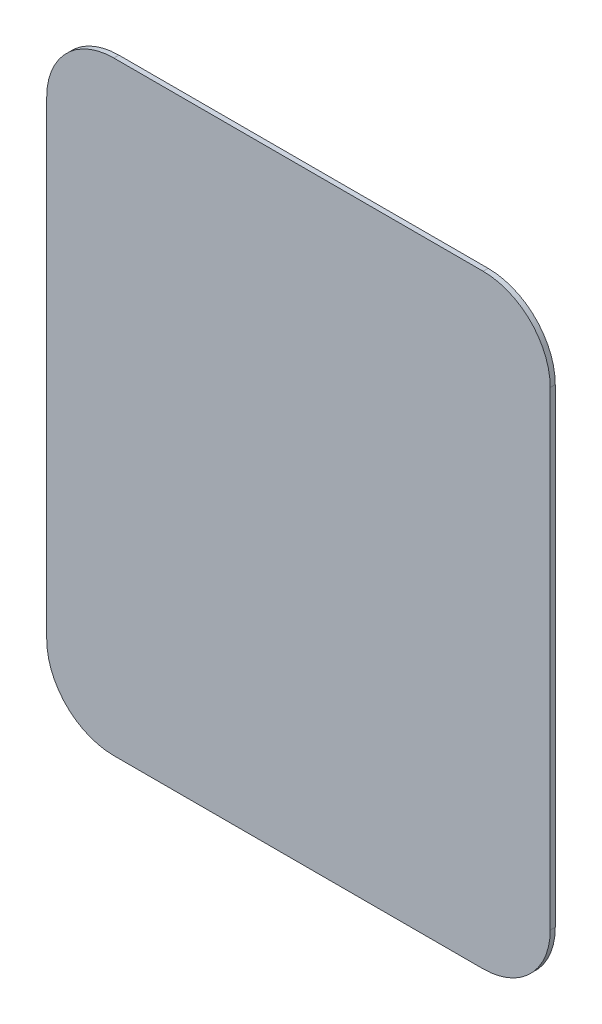
ISO-10303-21;
HEADER;
FILE_DESCRIPTION(('STEP AP214'),'2;1');
FILE_NAME('part.step','',(''),(''),'','','');
FILE_SCHEMA(('AUTOMOTIVE_DESIGN { 1 0 10303 214 1 1 1 1 }'));
ENDSEC;
DATA;
#1=APPLICATION_CONTEXT('core data for automotive mechanical design processes');
#2=APPLICATION_PROTOCOL_DEFINITION('international standard','automotive_design',2000,#1);
#3=PRODUCT_CONTEXT('',#1,'mechanical');
#4=PRODUCT('Part','Part','',(#3));
#5=PRODUCT_RELATED_PRODUCT_CATEGORY('part','',(#4));
#6=PRODUCT_DEFINITION_FORMATION('','',#4);
#7=PRODUCT_DEFINITION_CONTEXT('part definition',#1,'design');
#8=PRODUCT_DEFINITION('design','',#6,#7);
#9=PRODUCT_DEFINITION_SHAPE('','',#8);
#10=(LENGTH_UNIT() NAMED_UNIT(*) SI_UNIT(.MILLI.,.METRE.));
#11=(NAMED_UNIT(*) PLANE_ANGLE_UNIT() SI_UNIT($,.RADIAN.));
#12=(NAMED_UNIT(*) SI_UNIT($,.STERADIAN.) SOLID_ANGLE_UNIT());
#13=UNCERTAINTY_MEASURE_WITH_UNIT(LENGTH_MEASURE(1.E-05),#10,'distance_accuracy_value','');
#14=(GEOMETRIC_REPRESENTATION_CONTEXT(3) GLOBAL_UNCERTAINTY_ASSIGNED_CONTEXT((#13)) GLOBAL_UNIT_ASSIGNED_CONTEXT((#10,
#11,#12)) REPRESENTATION_CONTEXT('',''));
#15=CARTESIAN_POINT('',(0.,0.,0.));
#16=DIRECTION('',(0.,0.,1.));
#17=DIRECTION('',(1.,0.,0.));
#18=AXIS2_PLACEMENT_3D('',#15,#16,#17);
#19=CARTESIAN_POINT('',(-47.7083333333333,54.7395833333333,1.5));
#20=DIRECTION('',(0.,0.,-1.));
#21=DIRECTION('',(-1.,0.,0.));
#22=AXIS2_PLACEMENT_3D('',#19,#20,#21);
#23=CYLINDRICAL_SURFACE('',#22,20.);
#24=CARTESIAN_POINT('',(-47.7083333333333,54.7395833333333,0.));
#25=DIRECTION('',(0.,0.,-1.));
#26=DIRECTION('',(-1.,0.,0.));
#27=AXIS2_PLACEMENT_3D('',#24,#25,#26);
#28=CIRCLE('',#27,20.);
#29=CARTESIAN_POINT('',(-67.7083333333333,54.7395833333332,0.));
#30=VERTEX_POINT('',#29);
#31=CARTESIAN_POINT('',(-47.7083333333332,74.7395833333333,0.));
#32=VERTEX_POINT('',#31);
#33=EDGE_CURVE('E131',#30,#32,#28,.T.);
#34=ORIENTED_EDGE('',*,*,#33,.F.);
#35=DIRECTION('',(0.,0.,-1.));
#36=VECTOR('',#35,1.);
#37=CARTESIAN_POINT('',(-67.7083333333333,54.7395833333332,1.5));
#38=LINE('',#37,#36);
#39=CARTESIAN_POINT('',(-67.7083333333333,54.7395833333332,1.5));
#40=VERTEX_POINT('',#39);
#41=EDGE_CURVE('E11',#40,#30,#38,.T.);
#42=ORIENTED_EDGE('',*,*,#41,.F.);
#43=CARTESIAN_POINT('',(-47.7083333333333,54.7395833333333,1.5));
#44=DIRECTION('',(0.,0.,-1.));
#45=DIRECTION('',(-1.,0.,0.));
#46=AXIS2_PLACEMENT_3D('',#43,#44,#45);
#47=CIRCLE('',#46,20.);
#48=CARTESIAN_POINT('',(-47.7083333333332,74.7395833333333,1.5));
#49=VERTEX_POINT('',#48);
#50=EDGE_CURVE('E150',#40,#49,#47,.T.);
#51=ORIENTED_EDGE('',*,*,#50,.T.);
#52=DIRECTION('',(0.,0.,-1.));
#53=VECTOR('',#52,1.);
#54=CARTESIAN_POINT('',(-47.7083333333332,74.7395833333333,1.5));
#55=LINE('',#54,#53);
#56=EDGE_CURVE('E36',#49,#32,#55,.T.);
#57=ORIENTED_EDGE('',*,*,#56,.T.);
#58=EDGE_LOOP('',(#34,#42,#51,#57));
#59=FACE_BOUND('',#58,.T.);
#60=ADVANCED_FACE('F33',(#59),#23,.T.);
#61=CARTESIAN_POINT('',(-67.7083333333333,54.7395833333332,1.5));
#62=DIRECTION('',(1.,0.,0.));
#63=DIRECTION('',(0.,1.,0.));
#64=AXIS2_PLACEMENT_3D('',#61,#62,#63);
#65=PLANE('',#64);
#66=DIRECTION('',(0.,-1.,0.));
#67=VECTOR('',#66,1.);
#68=CARTESIAN_POINT('',(-67.7083333333333,54.7395833333332,0.));
#69=LINE('',#68,#67);
#70=CARTESIAN_POINT('',(-67.7083333333333,-85.2604166666665,0.));
#71=VERTEX_POINT('',#70);
#72=EDGE_CURVE('E78',#30,#71,#69,.T.);
#73=ORIENTED_EDGE('',*,*,#72,.T.);
#74=DIRECTION('',(0.,0.,-1.));
#75=VECTOR('',#74,1.);
#76=CARTESIAN_POINT('',(-67.7083333333333,-85.2604166666665,1.5));
#77=LINE('',#76,#75);
#78=CARTESIAN_POINT('',(-67.7083333333333,-85.2604166666665,1.5));
#79=VERTEX_POINT('',#78);
#80=EDGE_CURVE('E42',#79,#71,#77,.T.);
#81=ORIENTED_EDGE('',*,*,#80,.F.);
#82=DIRECTION('',(0.,-1.,0.));
#83=VECTOR('',#82,1.);
#84=CARTESIAN_POINT('',(-67.7083333333333,54.7395833333332,1.5));
#85=LINE('',#84,#83);
#86=EDGE_CURVE('E109',#40,#79,#85,.T.);
#87=ORIENTED_EDGE('',*,*,#86,.F.);
#88=ORIENTED_EDGE('',*,*,#41,.T.);
#89=EDGE_LOOP('',(#73,#81,#87,#88));
#90=FACE_BOUND('',#89,.T.);
#91=ADVANCED_FACE('F233',(#90),#65,.F.);
#92=CARTESIAN_POINT('',(-47.7083333333333,-85.2604166666667,1.5));
#93=DIRECTION('',(0.,0.,-1.));
#94=DIRECTION('',(-1.,0.,0.));
#95=AXIS2_PLACEMENT_3D('',#92,#93,#94);
#96=CYLINDRICAL_SURFACE('',#95,20.);
#97=CARTESIAN_POINT('',(-47.7083333333333,-85.2604166666667,0.));
#98=DIRECTION('',(0.,0.,1.));
#99=DIRECTION('',(1.,0.,0.));
#100=AXIS2_PLACEMENT_3D('',#97,#98,#99);
#101=CIRCLE('',#100,20.);
#102=CARTESIAN_POINT('',(-47.7083333333331,-105.260416666667,0.));
#103=VERTEX_POINT('',#102);
#104=EDGE_CURVE('E116',#71,#103,#101,.T.);
#105=ORIENTED_EDGE('',*,*,#104,.T.);
#106=DIRECTION('',(0.,0.,-1.));
#107=VECTOR('',#106,1.);
#108=CARTESIAN_POINT('',(-47.7083333333331,-105.260416666667,1.5));
#109=LINE('',#108,#107);
#110=CARTESIAN_POINT('',(-47.7083333333331,-105.260416666667,1.5));
#111=VERTEX_POINT('',#110);
#112=EDGE_CURVE('E113',#111,#103,#109,.T.);
#113=ORIENTED_EDGE('',*,*,#112,.F.);
#114=CARTESIAN_POINT('',(-47.7083333333333,-85.2604166666667,1.5));
#115=DIRECTION('',(0.,0.,1.));
#116=DIRECTION('',(1.,0.,0.));
#117=AXIS2_PLACEMENT_3D('',#114,#115,#116);
#118=CIRCLE('',#117,20.);
#119=EDGE_CURVE('E102',#79,#111,#118,.T.);
#120=ORIENTED_EDGE('',*,*,#119,.F.);
#121=ORIENTED_EDGE('',*,*,#80,.T.);
#122=EDGE_LOOP('',(#105,#113,#120,#121));
#123=FACE_BOUND('',#122,.T.);
#124=ADVANCED_FACE('F114',(#123),#96,.T.);
#125=CARTESIAN_POINT('',(-47.7083333333331,-105.260416666667,1.5));
#126=DIRECTION('',(0.,1.,0.));
#127=DIRECTION('',(0.,0.,1.));
#128=AXIS2_PLACEMENT_3D('',#125,#126,#127);
#129=PLANE('',#128);
#130=DIRECTION('',(1.,0.,0.));
#131=VECTOR('',#130,1.);
#132=CARTESIAN_POINT('',(-47.7083333333331,-105.260416666667,0.));
#133=LINE('',#132,#131);
#134=CARTESIAN_POINT('',(62.2916666666666,-105.260416666667,0.));
#135=VERTEX_POINT('',#134);
#136=EDGE_CURVE('E147',#103,#135,#133,.T.);
#137=ORIENTED_EDGE('',*,*,#136,.T.);
#138=DIRECTION('',(0.,0.,-1.));
#139=VECTOR('',#138,1.);
#140=CARTESIAN_POINT('',(62.2916666666666,-105.260416666667,1.5));
#141=LINE('',#140,#139);
#142=CARTESIAN_POINT('',(62.2916666666666,-105.260416666667,1.5));
#143=VERTEX_POINT('',#142);
#144=EDGE_CURVE('E119',#143,#135,#141,.T.);
#145=ORIENTED_EDGE('',*,*,#144,.F.);
#146=DIRECTION('',(1.,0.,0.));
#147=VECTOR('',#146,1.);
#148=CARTESIAN_POINT('',(-47.7083333333331,-105.260416666667,1.5));
#149=LINE('',#148,#147);
#150=EDGE_CURVE('E107',#111,#143,#149,.T.);
#151=ORIENTED_EDGE('',*,*,#150,.F.);
#152=ORIENTED_EDGE('',*,*,#112,.T.);
#153=EDGE_LOOP('',(#137,#145,#151,#152));
#154=FACE_BOUND('',#153,.T.);
#155=ADVANCED_FACE('F121',(#154),#129,.F.);
#156=CARTESIAN_POINT('',(62.2916666666667,-85.2604166666667,1.5));
#157=DIRECTION('',(0.,0.,-1.));
#158=DIRECTION('',(-1.,0.,0.));
#159=AXIS2_PLACEMENT_3D('',#156,#157,#158);
#160=CYLINDRICAL_SURFACE('',#159,20.);
#161=CARTESIAN_POINT('',(62.2916666666667,-85.2604166666667,0.));
#162=DIRECTION('',(0.,0.,1.));
#163=DIRECTION('',(1.,0.,0.));
#164=AXIS2_PLACEMENT_3D('',#161,#162,#163);
#165=CIRCLE('',#164,20.);
#166=CARTESIAN_POINT('',(82.2916666666667,-85.2604166666665,0.));
#167=VERTEX_POINT('',#166);
#168=EDGE_CURVE('E144',#135,#167,#165,.T.);
#169=ORIENTED_EDGE('',*,*,#168,.T.);
#170=DIRECTION('',(0.,0.,-1.));
#171=VECTOR('',#170,1.);
#172=CARTESIAN_POINT('',(82.2916666666667,-85.2604166666665,1.5));
#173=LINE('',#172,#171);
#174=CARTESIAN_POINT('',(82.2916666666667,-85.2604166666665,1.5));
#175=VERTEX_POINT('',#174);
#176=EDGE_CURVE('E154',#175,#167,#173,.T.);
#177=ORIENTED_EDGE('',*,*,#176,.F.);
#178=CARTESIAN_POINT('',(62.2916666666667,-85.2604166666667,1.5));
#179=DIRECTION('',(0.,0.,1.));
#180=DIRECTION('',(1.,0.,0.));
#181=AXIS2_PLACEMENT_3D('',#178,#179,#180);
#182=CIRCLE('',#181,20.);
#183=EDGE_CURVE('E124',#143,#175,#182,.T.);
#184=ORIENTED_EDGE('',*,*,#183,.F.);
#185=ORIENTED_EDGE('',*,*,#144,.T.);
#186=EDGE_LOOP('',(#169,#177,#184,#185));
#187=FACE_BOUND('',#186,.T.);
#188=ADVANCED_FACE('F165',(#187),#160,.T.);
#189=CARTESIAN_POINT('',(82.2916666666667,54.7395833333332,1.5));
#190=DIRECTION('',(1.,0.,0.));
#191=DIRECTION('',(0.,1.,0.));
#192=AXIS2_PLACEMENT_3D('',#189,#190,#191);
#193=PLANE('',#192);
#194=DIRECTION('',(0.,-1.,0.));
#195=VECTOR('',#194,1.);
#196=CARTESIAN_POINT('',(82.2916666666667,54.7395833333332,0.));
#197=LINE('',#196,#195);
#198=CARTESIAN_POINT('',(82.2916666666667,54.7395833333332,0.));
#199=VERTEX_POINT('',#198);
#200=EDGE_CURVE('E141',#199,#167,#197,.T.);
#201=ORIENTED_EDGE('',*,*,#200,.F.);
#202=DIRECTION('',(0.,0.,-1.));
#203=VECTOR('',#202,1.);
#204=CARTESIAN_POINT('',(82.2916666666667,54.7395833333332,1.5));
#205=LINE('',#204,#203);
#206=CARTESIAN_POINT('',(82.2916666666667,54.7395833333332,1.5));
#207=VERTEX_POINT('',#206);
#208=EDGE_CURVE('E156',#207,#199,#205,.T.);
#209=ORIENTED_EDGE('',*,*,#208,.F.);
#210=DIRECTION('',(0.,-1.,0.));
#211=VECTOR('',#210,1.);
#212=CARTESIAN_POINT('',(82.2916666666667,54.7395833333332,1.5));
#213=LINE('',#212,#211);
#214=EDGE_CURVE('E126',#207,#175,#213,.T.);
#215=ORIENTED_EDGE('',*,*,#214,.T.);
#216=ORIENTED_EDGE('',*,*,#176,.T.);
#217=EDGE_LOOP('',(#201,#209,#215,#216));
#218=FACE_BOUND('',#217,.T.);
#219=ADVANCED_FACE('F247',(#218),#193,.T.);
#220=CARTESIAN_POINT('',(62.2916666666667,54.7395833333333,1.5));
#221=DIRECTION('',(0.,0.,-1.));
#222=DIRECTION('',(-1.,0.,0.));
#223=AXIS2_PLACEMENT_3D('',#220,#221,#222);
#224=CYLINDRICAL_SURFACE('',#223,20.);
#225=CARTESIAN_POINT('',(62.2916666666667,54.7395833333333,0.));
#226=DIRECTION('',(0.,0.,1.));
#227=DIRECTION('',(1.,0.,0.));
#228=AXIS2_PLACEMENT_3D('',#225,#226,#227);
#229=CIRCLE('',#228,20.);
#230=CARTESIAN_POINT('',(62.2916666666665,74.7395833333333,0.));
#231=VERTEX_POINT('',#230);
#232=EDGE_CURVE('E138',#199,#231,#229,.T.);
#233=ORIENTED_EDGE('',*,*,#232,.T.);
#234=DIRECTION('',(0.,0.,-1.));
#235=VECTOR('',#234,1.);
#236=CARTESIAN_POINT('',(62.2916666666665,74.7395833333333,1.5));
#237=LINE('',#236,#235);
#238=CARTESIAN_POINT('',(62.2916666666665,74.7395833333333,1.5));
#239=VERTEX_POINT('',#238);
#240=EDGE_CURVE('E157',#239,#231,#237,.T.);
#241=ORIENTED_EDGE('',*,*,#240,.F.);
#242=CARTESIAN_POINT('',(62.2916666666667,54.7395833333333,1.5));
#243=DIRECTION('',(0.,0.,1.));
#244=DIRECTION('',(1.,0.,0.));
#245=AXIS2_PLACEMENT_3D('',#242,#243,#244);
#246=CIRCLE('',#245,20.);
#247=EDGE_CURVE('E170',#207,#239,#246,.T.);
#248=ORIENTED_EDGE('',*,*,#247,.F.);
#249=ORIENTED_EDGE('',*,*,#208,.T.);
#250=EDGE_LOOP('',(#233,#241,#248,#249));
#251=FACE_BOUND('',#250,.T.);
#252=ADVANCED_FACE('F250',(#251),#224,.T.);
#253=CARTESIAN_POINT('',(-47.7083333333332,74.7395833333333,1.5));
#254=DIRECTION('',(0.,1.,0.));
#255=DIRECTION('',(0.,0.,1.));
#256=AXIS2_PLACEMENT_3D('',#253,#254,#255);
#257=PLANE('',#256);
#258=DIRECTION('',(1.,0.,0.));
#259=VECTOR('',#258,1.);
#260=CARTESIAN_POINT('',(-47.7083333333332,74.7395833333333,0.));
#261=LINE('',#260,#259);
#262=EDGE_CURVE('E134',#32,#231,#261,.T.);
#263=ORIENTED_EDGE('',*,*,#262,.F.);
#264=ORIENTED_EDGE('',*,*,#56,.F.);
#265=DIRECTION('',(1.,0.,0.));
#266=VECTOR('',#265,1.);
#267=CARTESIAN_POINT('',(-47.7083333333332,74.7395833333333,1.5));
#268=LINE('',#267,#266);
#269=EDGE_CURVE('E172',#49,#239,#268,.T.);
#270=ORIENTED_EDGE('',*,*,#269,.T.);
#271=ORIENTED_EDGE('',*,*,#240,.T.);
#272=EDGE_LOOP('',(#263,#264,#270,#271));
#273=FACE_BOUND('',#272,.T.);
#274=ADVANCED_FACE('F159',(#273),#257,.T.);
#275=CARTESIAN_POINT('',(-47.7083333333333,54.7395833333333,1.5));
#276=DIRECTION('',(0.,0.,-1.));
#277=DIRECTION('',(-1.,0.,0.));
#278=AXIS2_PLACEMENT_3D('',#275,#276,#277);
#279=PLANE('',#278);
#280=ORIENTED_EDGE('',*,*,#50,.F.);
#281=ORIENTED_EDGE('',*,*,#86,.T.);
#282=ORIENTED_EDGE('',*,*,#119,.T.);
#283=ORIENTED_EDGE('',*,*,#150,.T.);
#284=ORIENTED_EDGE('',*,*,#183,.T.);
#285=ORIENTED_EDGE('',*,*,#214,.F.);
#286=ORIENTED_EDGE('',*,*,#247,.T.);
#287=ORIENTED_EDGE('',*,*,#269,.F.);
#288=EDGE_LOOP('',(#280,#281,#282,#283,#284,#285,#286,#287));
#289=FACE_BOUND('',#288,.T.);
#290=ADVANCED_FACE('F105',(#289),#279,.F.);
#291=CARTESIAN_POINT('',(-47.7083333333333,54.7395833333333,0.));
#292=DIRECTION('',(0.,0.,-1.));
#293=DIRECTION('',(-1.,0.,0.));
#294=AXIS2_PLACEMENT_3D('',#291,#292,#293);
#295=PLANE('',#294);
#296=CARTESIAN_POINT('',(47.7916666666667,-75.7604166666667,0.));
#297=DIRECTION('',(0.,0.,-1.));
#298=DIRECTION('',(-1.,0.,0.));
#299=AXIS2_PLACEMENT_3D('',#296,#297,#298);
#300=CIRCLE('',#299,2.5);
#301=CARTESIAN_POINT('',(45.2916666666667,-75.7604166666667,0.));
#302=VERTEX_POINT('',#301);
#303=EDGE_CURVE('E195',#302,#302,#300,.T.);
#304=ORIENTED_EDGE('',*,*,#303,.F.);
#305=EDGE_LOOP('',(#304));
#306=FACE_BOUND('',#305,.T.);
#307=CARTESIAN_POINT('',(-33.2083333333333,-75.7604166666667,0.));
#308=DIRECTION('',(0.,0.,-1.));
#309=DIRECTION('',(-1.,0.,0.));
#310=AXIS2_PLACEMENT_3D('',#307,#308,#309);
#311=CIRCLE('',#310,2.5);
#312=CARTESIAN_POINT('',(-35.7083333333333,-75.7604166666667,0.));
#313=VERTEX_POINT('',#312);
#314=EDGE_CURVE('E189',#313,#313,#311,.T.);
#315=ORIENTED_EDGE('',*,*,#314,.F.);
#316=EDGE_LOOP('',(#315));
#317=FACE_BOUND('',#316,.T.);
#318=CARTESIAN_POINT('',(-33.2083333333333,45.2395833333333,0.));
#319=DIRECTION('',(0.,0.,-1.));
#320=DIRECTION('',(-1.,0.,0.));
#321=AXIS2_PLACEMENT_3D('',#318,#319,#320);
#322=CIRCLE('',#321,2.5);
#323=CARTESIAN_POINT('',(-35.7083333333333,45.2395833333333,0.));
#324=VERTEX_POINT('',#323);
#325=EDGE_CURVE('E183',#324,#324,#322,.T.);
#326=ORIENTED_EDGE('',*,*,#325,.F.);
#327=EDGE_LOOP('',(#326));
#328=FACE_BOUND('',#327,.T.);
#329=CARTESIAN_POINT('',(47.7916666666667,45.2395833333333,0.));
#330=DIRECTION('',(0.,0.,-1.));
#331=DIRECTION('',(-1.,0.,0.));
#332=AXIS2_PLACEMENT_3D('',#329,#330,#331);
#333=CIRCLE('',#332,2.5);
#334=CARTESIAN_POINT('',(45.2916666666667,45.2395833333333,0.));
#335=VERTEX_POINT('',#334);
#336=EDGE_CURVE('E177',#335,#335,#333,.T.);
#337=ORIENTED_EDGE('',*,*,#336,.F.);
#338=EDGE_LOOP('',(#337));
#339=FACE_BOUND('',#338,.T.);
#340=ORIENTED_EDGE('',*,*,#33,.T.);
#341=ORIENTED_EDGE('',*,*,#262,.T.);
#342=ORIENTED_EDGE('',*,*,#232,.F.);
#343=ORIENTED_EDGE('',*,*,#200,.T.);
#344=ORIENTED_EDGE('',*,*,#168,.F.);
#345=ORIENTED_EDGE('',*,*,#136,.F.);
#346=ORIENTED_EDGE('',*,*,#104,.F.);
#347=ORIENTED_EDGE('',*,*,#72,.F.);
#348=EDGE_LOOP('',(#340,#341,#342,#343,#344,#345,#346,#347));
#349=FACE_BOUND('',#348,.T.);
#350=ADVANCED_FACE('F162',(#306,#317,#328,#339,#349),#295,.T.);
#351=CARTESIAN_POINT('',(47.7916666666667,45.2395833333333,1.4));
#352=DIRECTION('',(0.,0.,-1.));
#353=DIRECTION('',(-1.,0.,0.));
#354=AXIS2_PLACEMENT_3D('',#351,#352,#353);
#355=CYLINDRICAL_SURFACE('',#354,2.5);
#356=CARTESIAN_POINT('',(47.7916666666667,45.2395833333333,1.4));
#357=DIRECTION('',(0.,0.,-1.));
#358=DIRECTION('',(-1.,0.,0.));
#359=AXIS2_PLACEMENT_3D('',#356,#357,#358);
#360=CIRCLE('',#359,2.5);
#361=CARTESIAN_POINT('',(45.2916666666667,45.2395833333333,1.4));
#362=VERTEX_POINT('',#361);
#363=EDGE_CURVE('E135',#362,#362,#360,.T.);
#364=ORIENTED_EDGE('',*,*,#363,.F.);
#365=EDGE_LOOP('',(#364));
#366=FACE_BOUND('',#365,.T.);
#367=ORIENTED_EDGE('',*,*,#336,.T.);
#368=EDGE_LOOP('',(#367));
#369=FACE_BOUND('',#368,.T.);
#370=ADVANCED_FACE('F212',(#366,#369),#355,.F.);
#371=CARTESIAN_POINT('',(47.7916666666667,45.2395833333333,1.4));
#372=DIRECTION('',(0.,0.,-1.));
#373=DIRECTION('',(-1.,0.,0.));
#374=AXIS2_PLACEMENT_3D('',#371,#372,#373);
#375=PLANE('',#374);
#376=ORIENTED_EDGE('',*,*,#363,.T.);
#377=EDGE_LOOP('',(#376));
#378=FACE_BOUND('',#377,.T.);
#379=ADVANCED_FACE('F221',(#378),#375,.T.);
#380=CARTESIAN_POINT('',(-33.2083333333333,45.2395833333333,1.4));
#381=DIRECTION('',(0.,0.,-1.));
#382=DIRECTION('',(-1.,0.,0.));
#383=AXIS2_PLACEMENT_3D('',#380,#381,#382);
#384=CYLINDRICAL_SURFACE('',#383,2.5);
#385=CARTESIAN_POINT('',(-33.2083333333333,45.2395833333333,1.4));
#386=DIRECTION('',(0.,0.,-1.));
#387=DIRECTION('',(-1.,0.,0.));
#388=AXIS2_PLACEMENT_3D('',#385,#386,#387);
#389=CIRCLE('',#388,2.5);
#390=CARTESIAN_POINT('',(-35.7083333333333,45.2395833333333,1.4));
#391=VERTEX_POINT('',#390);
#392=EDGE_CURVE('E180',#391,#391,#389,.T.);
#393=ORIENTED_EDGE('',*,*,#392,.F.);
#394=EDGE_LOOP('',(#393));
#395=FACE_BOUND('',#394,.T.);
#396=ORIENTED_EDGE('',*,*,#325,.T.);
#397=EDGE_LOOP('',(#396));
#398=FACE_BOUND('',#397,.T.);
#399=ADVANCED_FACE('F227',(#395,#398),#384,.F.);
#400=CARTESIAN_POINT('',(-33.2083333333333,45.2395833333333,1.4));
#401=DIRECTION('',(0.,0.,-1.));
#402=DIRECTION('',(-1.,0.,0.));
#403=AXIS2_PLACEMENT_3D('',#400,#401,#402);
#404=PLANE('',#403);
#405=ORIENTED_EDGE('',*,*,#392,.T.);
#406=EDGE_LOOP('',(#405));
#407=FACE_BOUND('',#406,.T.);
#408=ADVANCED_FACE('F282',(#407),#404,.T.);
#409=CARTESIAN_POINT('',(-33.2083333333333,-75.7604166666667,1.4));
#410=DIRECTION('',(0.,0.,-1.));
#411=DIRECTION('',(-1.,0.,0.));
#412=AXIS2_PLACEMENT_3D('',#409,#410,#411);
#413=CYLINDRICAL_SURFACE('',#412,2.5);
#414=CARTESIAN_POINT('',(-33.2083333333333,-75.7604166666667,1.4));
#415=DIRECTION('',(0.,0.,-1.));
#416=DIRECTION('',(-1.,0.,0.));
#417=AXIS2_PLACEMENT_3D('',#414,#415,#416);
#418=CIRCLE('',#417,2.5);
#419=CARTESIAN_POINT('',(-35.7083333333333,-75.7604166666667,1.4));
#420=VERTEX_POINT('',#419);
#421=EDGE_CURVE('E186',#420,#420,#418,.T.);
#422=ORIENTED_EDGE('',*,*,#421,.F.);
#423=EDGE_LOOP('',(#422));
#424=FACE_BOUND('',#423,.T.);
#425=ORIENTED_EDGE('',*,*,#314,.T.);
#426=EDGE_LOOP('',(#425));
#427=FACE_BOUND('',#426,.T.);
#428=ADVANCED_FACE('F292',(#424,#427),#413,.F.);
#429=CARTESIAN_POINT('',(-33.2083333333333,-75.7604166666667,1.4));
#430=DIRECTION('',(0.,0.,-1.));
#431=DIRECTION('',(-1.,0.,0.));
#432=AXIS2_PLACEMENT_3D('',#429,#430,#431);
#433=PLANE('',#432);
#434=ORIENTED_EDGE('',*,*,#421,.T.);
#435=EDGE_LOOP('',(#434));
#436=FACE_BOUND('',#435,.T.);
#437=ADVANCED_FACE('F206',(#436),#433,.T.);
#438=CARTESIAN_POINT('',(47.7916666666667,-75.7604166666667,1.4));
#439=DIRECTION('',(0.,0.,-1.));
#440=DIRECTION('',(-1.,0.,0.));
#441=AXIS2_PLACEMENT_3D('',#438,#439,#440);
#442=CYLINDRICAL_SURFACE('',#441,2.5);
#443=CARTESIAN_POINT('',(47.7916666666667,-75.7604166666667,1.4));
#444=DIRECTION('',(0.,0.,-1.));
#445=DIRECTION('',(-1.,0.,0.));
#446=AXIS2_PLACEMENT_3D('',#443,#444,#445);
#447=CIRCLE('',#446,2.5);
#448=CARTESIAN_POINT('',(45.2916666666667,-75.7604166666667,1.4));
#449=VERTEX_POINT('',#448);
#450=EDGE_CURVE('E192',#449,#449,#447,.T.);
#451=ORIENTED_EDGE('',*,*,#450,.F.);
#452=EDGE_LOOP('',(#451));
#453=FACE_BOUND('',#452,.T.);
#454=ORIENTED_EDGE('',*,*,#303,.T.);
#455=EDGE_LOOP('',(#454));
#456=FACE_BOUND('',#455,.T.);
#457=ADVANCED_FACE('F203',(#453,#456),#442,.F.);
#458=CARTESIAN_POINT('',(47.7916666666667,-75.7604166666667,1.4));
#459=DIRECTION('',(0.,0.,-1.));
#460=DIRECTION('',(-1.,0.,0.));
#461=AXIS2_PLACEMENT_3D('',#458,#459,#460);
#462=PLANE('',#461);
#463=ORIENTED_EDGE('',*,*,#450,.T.);
#464=EDGE_LOOP('',(#463));
#465=FACE_BOUND('',#464,.T.);
#466=ADVANCED_FACE('F201',(#465),#462,.T.);
#467=CLOSED_SHELL('',(#60,#91,#124,#155,#188,#219,#252,#274,#290,#350,#370,#379,#399,#408,#428,
#437,#457,#466));
#468=MANIFOLD_SOLID_BREP('B2',#467);
#469=ADVANCED_BREP_SHAPE_REPRESENTATION('',(#18,#468),#14);
#470=SHAPE_DEFINITION_REPRESENTATION(#9,#469);
ENDSEC;
END-ISO-10303-21;
